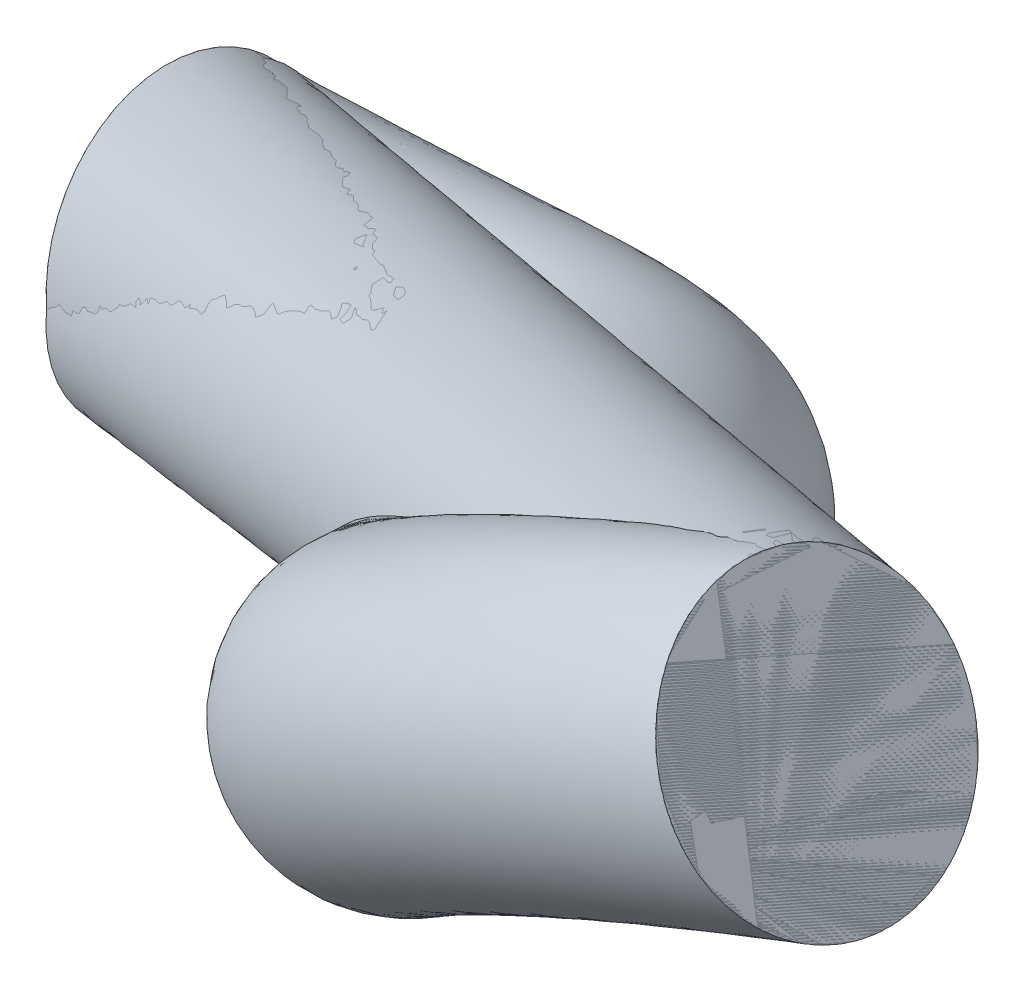
ISO-10303-21;
HEADER;
FILE_DESCRIPTION(('STEP AP214'),'2;1');
FILE_NAME('part.step','',(''),(''),'','','');
FILE_SCHEMA(('AUTOMOTIVE_DESIGN { 1 0 10303 214 1 1 1 1 }'));
ENDSEC;
DATA;
#1=APPLICATION_CONTEXT('core data for automotive mechanical design processes');
#2=APPLICATION_PROTOCOL_DEFINITION('international standard','automotive_design',2000,#1);
#3=PRODUCT_CONTEXT('',#1,'mechanical');
#4=PRODUCT('Part','Part','',(#3));
#5=PRODUCT_RELATED_PRODUCT_CATEGORY('part','',(#4));
#6=PRODUCT_DEFINITION_FORMATION('','',#4);
#7=PRODUCT_DEFINITION_CONTEXT('part definition',#1,'design');
#8=PRODUCT_DEFINITION('design','',#6,#7);
#9=PRODUCT_DEFINITION_SHAPE('','',#8);
#10=(LENGTH_UNIT() NAMED_UNIT(*) SI_UNIT(.MILLI.,.METRE.));
#11=(NAMED_UNIT(*) PLANE_ANGLE_UNIT() SI_UNIT($,.RADIAN.));
#12=(NAMED_UNIT(*) SI_UNIT($,.STERADIAN.) SOLID_ANGLE_UNIT());
#13=UNCERTAINTY_MEASURE_WITH_UNIT(LENGTH_MEASURE(1.E-05),#10,'distance_accuracy_value','');
#14=(GEOMETRIC_REPRESENTATION_CONTEXT(3) GLOBAL_UNCERTAINTY_ASSIGNED_CONTEXT((#13)) GLOBAL_UNIT_ASSIGNED_CONTEXT((#10,
#11,#12)) REPRESENTATION_CONTEXT('',''));
#15=CARTESIAN_POINT('',(0.,0.,0.));
#16=DIRECTION('',(0.,0.,1.));
#17=DIRECTION('',(1.,0.,0.));
#18=AXIS2_PLACEMENT_3D('',#15,#16,#17);
#19=CARTESIAN_POINT('',(0.,0.,0.));
#20=DIRECTION('',(0.986252063805547,0.164566009516546,-0.0149965046294042));
#21=DIRECTION('',(-0.164584517687191,0.986362984168442,0.));
#22=AXIS2_PLACEMENT_3D('',#19,#20,#21);
#23=PLANE('',#22);
#24=CARTESIAN_POINT('',(0.,0.,0.));
#25=DIRECTION('',(0.986252063805547,0.164566009516546,-0.0149965046294042));
#26=DIRECTION('',(-0.154927182454119,0.952408669839192,0.262517225629039));
#27=AXIS2_PLACEMENT_3D('',#24,#25,#26);
#28=CIRCLE('',#27,1.1);
#29=CARTESIAN_POINT('',(0.181637129272555,-1.08344944835674,0.0560824939271524));
#30=VERTEX_POINT('',#29);
#31=EDGE_CURVE('E12',#30,#30,#28,.T.);
#32=ORIENTED_EDGE('',*,*,#31,.F.);
#33=EDGE_LOOP('',(#32));
#34=FACE_BOUND('',#33,.T.);
#35=ADVANCED_FACE('F78',(#34),#23,.F.);
#36=CARTESIAN_POINT('',(12.,6.23926176341122,7.16624702187243));
#37=DIRECTION('',(0.866025403784438,0.499846355518911,0.0123943888297814));
#38=DIRECTION('',(-0.499884753360116,0.866091931239459,0.));
#39=AXIS2_PLACEMENT_3D('',#36,#37,#38);
#40=PLANE('',#39);
#41=CARTESIAN_POINT('',(12.,6.23926176341122,7.16624702187243));
#42=DIRECTION('',(0.866025403784438,0.499846355518911,0.0123943888297814));
#43=DIRECTION('',(-0.499884753360116,0.866091931239459,0.));
#44=AXIS2_PLACEMENT_3D('',#41,#42,#43);
#45=CIRCLE('',#44,1.1);
#46=CARTESIAN_POINT('',(12.4702423502606,5.43917079747186,6.57571626209479));
#47=VERTEX_POINT('',#46);
#48=EDGE_CURVE('E86',#47,#47,#45,.T.);
#49=ORIENTED_EDGE('',*,*,#48,.T.);
#50=EDGE_LOOP('',(#49));
#51=FACE_BOUND('',#50,.T.);
#52=ADVANCED_FACE('F110',(#51),#40,.T.);
#53=CARTESIAN_POINT('',(12.4702423502606,5.43917079747186,6.57571626209479));
#54=CARTESIAN_POINT('',(0.181637129272555,-1.08344944835674,0.0560824939271524));
#55=CARTESIAN_POINT('',(12.4940138510578,5.39606721362045,6.65304526433065));
#56=CARTESIAN_POINT('',(0.182222019475779,-1.07861316523766,0.147619623261756));
#57=CARTESIAN_POINT('',(12.5161390502769,5.35541602802259,6.74650387669227));
#58=CARTESIAN_POINT('',(0.181043057697036,-1.06216340736333,0.250598121359932));
#59=CARTESIAN_POINT('',(12.5464707475803,5.29727676071481,6.97182200330451));
#60=CARTESIAN_POINT('',(0.17163069267193,-0.985559710921361,0.472209776108738));
#61=CARTESIAN_POINT('',(12.5545405529484,5.28000849698423,7.10436764650442));
#62=CARTESIAN_POINT('',(0.16330322376293,-0.92480471848895,0.591252400316749));
#63=CARTESIAN_POINT('',(12.5401568189474,5.29767787687492,7.39681481379265));
#64=CARTESIAN_POINT('',(0.135738601999572,-0.739071921967012,0.81661425238499));
#65=CARTESIAN_POINT('',(12.5170170999344,5.33379996713204,7.55689445629629));
#66=CARTESIAN_POINT('',(0.116291234885146,-0.612893304653535,0.922285915520443));
#67=CARTESIAN_POINT('',(12.4289604230738,5.47891499254113,7.85736127265259));
#68=CARTESIAN_POINT('',(0.0670472675572752,-0.304408415983946,1.06893093526143));
#69=CARTESIAN_POINT('',(12.3636317346091,5.58867026287107,7.99577325540651));
#70=CARTESIAN_POINT('',(0.0372915373174332,-0.122539510630433,1.10779263433644));
#71=CARTESIAN_POINT('',(12.2068842845222,5.85536725151752,8.19261684199906));
#72=CARTESIAN_POINT('',(-0.0232541724400874,0.238610305488481,1.08909846969405));
#73=CARTESIAN_POINT('',(12.1165502803401,6.01046331593337,8.2496862064841));
#74=CARTESIAN_POINT('',(-0.0536251505061572,0.415391909567939,1.03167197735827));
#75=CARTESIAN_POINT('',(11.9442651715892,6.30830522668448,8.2761568349874));
#76=CARTESIAN_POINT('',(-0.10494153156448,0.706740625524921,0.853977826031315));
#77=CARTESIAN_POINT('',(11.863007834572,6.4498088678276,8.24717910787245));
#78=CARTESIAN_POINT('',(-0.125818864152918,0.821095283666699,0.735855461129889));
#79=CARTESIAN_POINT('',(11.7269140164897,6.6881685970375,8.14370178371307));
#80=CARTESIAN_POINT('',(-0.15637812375678,0.982066310618919,0.492547211004959));
#81=CARTESIAN_POINT('',(11.6716945781355,6.78565931495293,8.07036669136021));
#82=CARTESIAN_POINT('',(-0.166262804342842,1.02994518287508,0.36788138207252));
#83=CARTESIAN_POINT('',(11.5851845947208,6.9393827829916,7.91559730618274));
#84=CARTESIAN_POINT('',(-0.178550021694831,1.08277758053012,0.139569738715882));
#85=CARTESIAN_POINT('',(11.5535291505365,6.99624914549917,7.83410678388594));
#86=CARTESIAN_POINT('',(-0.181052239069346,1.08828573147583,0.0354546354074498));
#87=CARTESIAN_POINT('',(11.5059861489422,7.08245631320199,7.67944877941421));
#88=CARTESIAN_POINT('',(-0.182222019475792,1.07861316523766,-0.147619623261758));
#89=CARTESIAN_POINT('',(11.4838609497231,7.12310749879985,7.58599016705259));
#90=CARTESIAN_POINT('',(-0.18104305769705,1.06216340736333,-0.250598121359933));
#91=CARTESIAN_POINT('',(11.4535292524197,7.18124676610763,7.36067204044035));
#92=CARTESIAN_POINT('',(-0.171630692671944,0.98555971092136,-0.47220977610874));
#93=CARTESIAN_POINT('',(11.4454594470516,7.19851502983821,7.22812639724046));
#94=CARTESIAN_POINT('',(-0.163303223762944,0.924804718488949,-0.59125240031675));
#95=CARTESIAN_POINT('',(11.4598431810526,7.18084564994752,6.93567922995222));
#96=CARTESIAN_POINT('',(-0.135738601999585,0.739071921967011,-0.816614252384992));
#97=CARTESIAN_POINT('',(11.4829829000656,7.14472355969039,6.77559958744858));
#98=CARTESIAN_POINT('',(-0.11629123488516,0.612893304653534,-0.922285915520444));
#99=CARTESIAN_POINT('',(11.5710395769262,6.9996085342813,6.47513277109227));
#100=CARTESIAN_POINT('',(-0.067047267557289,0.304408415983946,-1.06893093526143));
#101=CARTESIAN_POINT('',(11.6363682653909,6.88985326395137,6.33672078833836));
#102=CARTESIAN_POINT('',(-0.0372915373174471,0.122539510630432,-1.10779263433644));
#103=CARTESIAN_POINT('',(11.7931157154778,6.62315627530492,6.13987720174581));
#104=CARTESIAN_POINT('',(0.0232541724400734,-0.238610305488481,-1.08909846969406));
#105=CARTESIAN_POINT('',(11.8834497196599,6.46806021088907,6.08280783726076));
#106=CARTESIAN_POINT('',(0.0536251505061432,-0.415391909567939,-1.03167197735827));
#107=CARTESIAN_POINT('',(12.0557348284107,6.17021830013795,6.05633720875747));
#108=CARTESIAN_POINT('',(0.104941531564466,-0.706740625524921,-0.853977826031317));
#109=CARTESIAN_POINT('',(12.136992165428,6.02871465899484,6.08531493587242));
#110=CARTESIAN_POINT('',(0.125818864152904,-0.8210952836667,-0.735855461129892));
#111=CARTESIAN_POINT('',(12.2730859835103,5.79035492978493,6.1887922600318));
#112=CARTESIAN_POINT('',(0.156378123756766,-0.98206631061892,-0.492547211004962));
#113=CARTESIAN_POINT('',(12.3283054218645,5.69286421186951,6.26212735238467));
#114=CARTESIAN_POINT('',(0.166262804342828,-1.02994518287508,-0.367881382072523));
#115=CARTESIAN_POINT('',(12.4148154052791,5.53914074383084,6.41689673756214));
#116=CARTESIAN_POINT('',(0.178550021694817,-1.08277758053012,-0.139569738715884));
#117=CARTESIAN_POINT('',(12.4464708494635,5.48227438132327,6.49838725985893));
#118=CARTESIAN_POINT('',(0.181052239069332,-1.08828573147583,-0.0354546354074517));
#119=CARTESIAN_POINT('',(12.4702423502606,5.43917079747186,6.57571626209479));
#120=CARTESIAN_POINT('',(0.181637129272555,-1.08344944835674,0.0560824939271524));
#121=B_SPLINE_SURFACE_WITH_KNOTS('',3,1,((#53,#54),(#55,#56),(#57,#58),(#59,#60),(#61,#62),(#63,
#64),(#65,#66),(#67,#68),(#69,#70),(#71,#72),(#73,#74),(#75,#76),(#77,#78),(#79,#80),(#81,#82),
(#83,#84),(#85,#86),(#87,#88),(#89,#90),(#91,#92),(#93,#94),(#95,#96),(#97,#98),(#99,#100),
(#101,#102),(#103,#104),(#105,#106),(#107,#108),(#109,#110),(#111,#112),(#113,#114),(#115,#116),
(#117,#118),(#119,#120)),.UNSPECIFIED.,.T.,.F.,.F.,(4,2,2,2,2,2,2,2,2,2,2,2,2,2,2,2,4),(2,2),
(0.,0.0624999999999998,0.125,0.187499999999999,0.249999999999999,0.312499999999999,
0.374999999999999,0.437499999999998,0.499999999999998,0.562499999999998,0.624999999999999,
0.687499999999999,0.749999999999999,0.812499999999999,0.875,0.9375,1.),(0.,1.),.UNSPECIFIED.);
#122=CARTESIAN_POINT('',(12.4702423502606,5.43917079747186,6.57571626209479));
#123=CARTESIAN_POINT('',(12.3422360458754,5.37122683657781,6.50780341034305));
#124=CARTESIAN_POINT('',(12.2142297414901,5.30328287568376,6.4398905585913));
#125=CARTESIAN_POINT('',(11.9582171327195,5.16739495389567,6.30406485508781));
#126=CARTESIAN_POINT('',(11.8302108283342,5.09945099300162,6.23615200333606));
#127=CARTESIAN_POINT('',(11.5741982195636,4.96356307121352,6.10032629983257));
#128=CARTESIAN_POINT('',(11.4461919151783,4.89561911031948,6.03241344808082));
#129=CARTESIAN_POINT('',(11.1901793064077,4.75973118853138,5.89658774457733));
#130=CARTESIAN_POINT('',(11.0621730020224,4.69178722763733,5.82867489282558));
#131=CARTESIAN_POINT('',(10.8061603932518,4.55589930584924,5.69284918932209));
#132=CARTESIAN_POINT('',(10.6781540888666,4.48795534495519,5.62493633757034));
#133=CARTESIAN_POINT('',(10.422141480096,4.35206742316709,5.48911063406685));
#134=CARTESIAN_POINT('',(10.2941351757107,4.28412346227304,5.42119778231511));
#135=CARTESIAN_POINT('',(10.0381225669401,4.14823554048495,5.28537207881161));
#136=CARTESIAN_POINT('',(9.91011626255479,4.0802915795909,5.21745922705987));
#137=CARTESIAN_POINT('',(9.65410365378421,3.9444036578028,5.08163352355638));
#138=CARTESIAN_POINT('',(9.52609734939892,3.87645969690876,5.01372067180463));
#139=CARTESIAN_POINT('',(9.27008474062833,3.74057177512066,4.87789496830114));
#140=CARTESIAN_POINT('',(9.14207843624304,3.67262781422661,4.80998211654939));
#141=CARTESIAN_POINT('',(8.88606582747245,3.53673989243852,4.6741564130459));
#142=CARTESIAN_POINT('',(8.75805952308716,3.46879593154447,4.60624356129415));
#143=CARTESIAN_POINT('',(8.50204691431657,3.33290800975637,4.47041785779066));
#144=CARTESIAN_POINT('',(8.37404060993128,3.26496404886232,4.40250500603891));
#145=CARTESIAN_POINT('',(8.1180280011607,3.12907612707423,4.26667930253542));
#146=CARTESIAN_POINT('',(7.9900216967754,3.06113216618018,4.19876645078367));
#147=CARTESIAN_POINT('',(7.73400908800482,2.92524424439208,4.06294074728018));
#148=CARTESIAN_POINT('',(7.60600278361953,2.85730028349804,3.99502789552843));
#149=CARTESIAN_POINT('',(7.34999017484894,2.72141236170994,3.85920219202494));
#150=CARTESIAN_POINT('',(7.22198387046365,2.65346840081589,3.7912893402732));
#151=CARTESIAN_POINT('',(6.96597126169306,2.5175804790278,3.6554636367697));
#152=CARTESIAN_POINT('',(6.83796495730777,2.44963651813375,3.58755078501796));
#153=CARTESIAN_POINT('',(6.58195234853719,2.31374859634565,3.45172508151446));
#154=CARTESIAN_POINT('',(6.45394604415189,2.24580463545161,3.38381222976272));
#155=CARTESIAN_POINT('',(6.19793343538131,2.10991671366351,3.24798652625923));
#156=CARTESIAN_POINT('',(6.06992713099601,2.04197275276946,3.18007367450748));
#157=CARTESIAN_POINT('',(5.81391452222543,1.90608483098137,3.04424797100399));
#158=CARTESIAN_POINT('',(5.68590821784014,1.83814087008732,2.97633511925224));
#159=CARTESIAN_POINT('',(5.42989560906955,1.70225294829922,2.84050941574875));
#160=CARTESIAN_POINT('',(5.30188930468426,1.63430898740517,2.772596563997));
#161=CARTESIAN_POINT('',(5.04587669591367,1.49842106561708,2.63677086049351));
#162=CARTESIAN_POINT('',(4.91787039152838,1.43047710472303,2.56885800874176));
#163=CARTESIAN_POINT('',(4.6618577827578,1.29458918293493,2.43303230523827));
#164=CARTESIAN_POINT('',(4.5338514783725,1.22664522204089,2.36511945348652));
#165=CARTESIAN_POINT('',(4.27783886960192,1.09075730025279,2.22929374998303));
#166=CARTESIAN_POINT('',(4.14983256521663,1.02281333935874,2.16138089823129));
#167=CARTESIAN_POINT('',(3.89381995644604,0.886925417570646,2.02555519472779));
#168=CARTESIAN_POINT('',(3.76581365206075,0.818981456676598,1.95764234297605));
#169=CARTESIAN_POINT('',(3.50980104329016,0.683093534888502,1.82181663947255));
#170=CARTESIAN_POINT('',(3.38179473890487,0.615149573994454,1.75390378772081));
#171=CARTESIAN_POINT('',(3.12578213013429,0.479261652206359,1.61807808421732));
#172=CARTESIAN_POINT('',(2.99777582574899,0.411317691312311,1.55016523246557));
#173=CARTESIAN_POINT('',(2.74176321697841,0.275429769524215,1.41433952896208));
#174=CARTESIAN_POINT('',(2.61375691259311,0.207485808630167,1.34642667721033));
#175=CARTESIAN_POINT('',(2.35774430382253,0.0715978868420709,1.21060097370684));
#176=CARTESIAN_POINT('',(2.22973799943724,0.00365392594802291,1.14268812195509));
#177=CARTESIAN_POINT('',(1.97372539066665,-0.132233995840073,1.0068624184516));
#178=CARTESIAN_POINT('',(1.84571908628136,-0.200177956734121,0.938949566699854));
#179=CARTESIAN_POINT('',(1.58970647751077,-0.336065878522217,0.803123863196361));
#180=CARTESIAN_POINT('',(1.46170017312548,-0.404009839416265,0.735211011444615));
#181=CARTESIAN_POINT('',(1.2056875643549,-0.539897761204361,0.599385307941122));
#182=CARTESIAN_POINT('',(1.0776812599696,-0.607841722098409,0.531472456189376));
#183=CARTESIAN_POINT('',(0.821668651199018,-0.743729643886505,0.395646752685884));
#184=CARTESIAN_POINT('',(0.693662346813726,-0.811673604780552,0.327733900934137));
#185=CARTESIAN_POINT('',(0.437649738043141,-0.947561526568648,0.191908197430645));
#186=CARTESIAN_POINT('',(0.309643433657848,-1.0155054874627,0.123995345678899));
#187=CARTESIAN_POINT('',(0.181637129272555,-1.08344944835674,0.0560824939271524));
#188=B_SPLINE_CURVE_WITH_KNOTS('',3,(#122,#123,#124,#125,#126,#127,#128,#129,#130,#131,#132,
#133,#134,#135,#136,#137,#138,#139,#140,#141,#142,#143,#144,#145,#146,#147,#148,#149,#150,#151,
#152,#153,#154,#155,#156,#157,#158,#159,#160,#161,#162,#163,#164,#165,#166,#167,#168,#169,#170,
#171,#172,#173,#174,#175,#176,#177,#178,#179,#180,#181,#182,#183,#184,#185,#186,#187),
.UNSPECIFIED.,.F.,.F.,(4,2,2,2,2,2,2,2,2,2,2,2,2,2,2,2,2,2,2,2,2,2,2,2,2,2,2,2,2,2,2,2,4),(0.,
0.480132649334183,0.960265298668365,1.44039794800255,1.92053059733673,2.40066324667091,
2.88079589600509,3.36092854533928,3.84106119467346,4.32119384400764,4.80132649334182,
5.28145914267601,5.76159179201019,6.24172444134437,6.72185709067855,7.20198974001273,
7.68212238934692,8.1622550386811,8.64238768801528,9.12252033734947,9.60265298668365,
10.0827856360178,10.562918285352,11.0430509346862,11.5231835840204,12.0033162333546,
12.4834488826887,12.9635815320229,13.4437141813571,13.9238468306913,14.4039794800255,
14.8841121293597,15.3642447786938),.UNSPECIFIED.);
#189=EDGE_CURVE('BSEAM118',#47,#30,#188,.T.);
#190=ORIENTED_EDGE('',*,*,#48,.F.);
#191=ORIENTED_EDGE('',*,*,#31,.T.);
#192=ORIENTED_EDGE('',*,*,#189,.T.);
#193=ORIENTED_EDGE('',*,*,#189,.F.);
#194=EDGE_LOOP('',(#190,#192,#191,#193));
#195=FACE_BOUND('',#194,.T.);
#196=ADVANCED_FACE('F118',(#195),#121,.T.);
#197=CLOSED_SHELL('',(#35,#52,#196));
#198=MANIFOLD_SOLID_BREP('B2',#197);
#199=CARTESIAN_POINT('',(0.,0.,0.));
#200=DIRECTION('',(0.986252063805547,0.164566009516546,-0.0149965046294042));
#201=DIRECTION('',(-0.154927182454119,0.952408669839192,0.262517225629039));
#202=AXIS2_PLACEMENT_3D('',#199,#200,#201);
#203=PLANE('',#202);
#204=CARTESIAN_POINT('',(0.,0.,0.));
#205=DIRECTION('',(0.986252063805547,0.164566009516546,-0.0149965046294042));
#206=DIRECTION('',(-0.154927182454119,0.952408669839192,0.262517225629039));
#207=AXIS2_PLACEMENT_3D('',#204,#205,#206);
#208=CIRCLE('',#207,1.1);
#209=CARTESIAN_POINT('',(-0.170419900699537,1.04764953682311,0.288768948191942));
#210=VERTEX_POINT('',#209);
#211=EDGE_CURVE('E184',#210,#210,#208,.T.);
#212=ORIENTED_EDGE('',*,*,#211,.F.);
#213=EDGE_LOOP('',(#212));
#214=FACE_BOUND('',#213,.T.);
#215=ADVANCED_FACE('F177',(#214),#203,.F.);
#216=CARTESIAN_POINT('',(12.,6.23926176341122,7.16624702187243));
#217=DIRECTION('',(0.866025403784438,0.499846355518911,0.0123943888297814));
#218=DIRECTION('',(-0.499884753360116,0.866091931239459,0.));
#219=AXIS2_PLACEMENT_3D('',#216,#217,#218);
#220=PLANE('',#219);
#221=CARTESIAN_POINT('',(12.,6.23926176341122,7.16624702187243));
#222=DIRECTION('',(0.866025403784438,0.499846355518911,0.0123943888297814));
#223=DIRECTION('',(-0.499884753360116,0.866091931239459,0.));
#224=AXIS2_PLACEMENT_3D('',#221,#222,#223);
#225=CIRCLE('',#224,1.1);
#226=CARTESIAN_POINT('',(11.4501267713039,7.19196288777462,7.16624702187243));
#227=VERTEX_POINT('',#226);
#228=EDGE_CURVE('E76',#227,#227,#225,.T.);
#229=ORIENTED_EDGE('',*,*,#228,.T.);
#230=EDGE_LOOP('',(#229));
#231=FACE_BOUND('',#230,.T.);
#232=ADVANCED_FACE('F191',(#231),#220,.T.);
#233=CARTESIAN_POINT('',(-0.170419900699539,1.04764953682311,0.288768948191941));
#234=CARTESIAN_POINT('',(0.473264334735306,1.06923604834696,0.299212840866446));
#235=CARTESIAN_POINT('',(1.0991581380759,1.12236874517422,0.319440903231738));
#236=CARTESIAN_POINT('',(1.98942101504521,1.26299164667755,0.412783192179105));
#237=CARTESIAN_POINT('',(2.28120000959659,1.32228667833676,0.453094852170053));
#238=CARTESIAN_POINT('',(2.836379990738,1.46171020795116,0.579134628883695));
#239=CARTESIAN_POINT('',(3.09665258659056,1.54037140772899,0.664881578208361));
#240=CARTESIAN_POINT('',(3.57208294382386,1.71568499336394,0.902735057650312));
#241=CARTESIAN_POINT('',(3.79047001432895,1.81280893740871,1.07070932425622));
#242=CARTESIAN_POINT('',(4.18608275360607,2.01502418161229,1.4852776973141));
#243=CARTESIAN_POINT('',(4.36361066943153,2.12046114577217,1.72918360916092));
#244=CARTESIAN_POINT('',(4.68039247795302,2.32801144849916,2.25686012619045));
#245=CARTESIAN_POINT('',(4.82378862308739,2.43128069770416,2.53384972997274));
#246=CARTESIAN_POINT('',(5.10010727050088,2.64847341687711,3.08957022983166));
#247=CARTESIAN_POINT('',(5.23333931798411,2.76310288940918,3.37121979803631));
#248=CARTESIAN_POINT('',(5.64221161659854,3.13553749812254,4.18756164369797));
#249=CARTESIAN_POINT('',(5.92164780973814,3.42818052419124,4.70729896274631));
#250=CARTESIAN_POINT('',(6.65149195493829,4.1773414021836,5.64594572284659));
#251=CARTESIAN_POINT('',(7.10439172283666,4.62343855990236,6.03695758366435));
#252=CARTESIAN_POINT('',(7.95320817163656,5.28288363850914,6.46433675113768));
#253=CARTESIAN_POINT('',(8.24866706838278,5.48931377824904,6.57984178370921));
#254=CARTESIAN_POINT('',(8.85876197277774,5.88083893843533,6.77336934676646));
#255=CARTESIAN_POINT('',(9.17293410140316,6.06543378651149,6.85044815004052));
#256=CARTESIAN_POINT('',(10.1317360367405,6.59070820004162,7.03938693949413));
#257=CARTESIAN_POINT('',(10.792457758331,6.90298063777938,7.10934730681903));
#258=CARTESIAN_POINT('',(11.4501267713039,7.19196288777462,7.16624702187243));
#259=CARTESIAN_POINT('',(-0.0439546314891411,0.483163000248157,2.41135262986604));
#260=CARTESIAN_POINT('',(0.59255118795713,0.50924716906367,2.42342033963845));
#261=CARTESIAN_POINT('',(1.1722451965718,0.566164253720242,2.44814072249747));
#262=CARTESIAN_POINT('',(1.94592953815061,0.699131332202064,2.53920917145489));
#263=CARTESIAN_POINT('',(2.16438022463886,0.749048980074052,2.57703818659255));
#264=CARTESIAN_POINT('',(2.49681229862738,0.838912724686828,2.66484808751747));
#265=CARTESIAN_POINT('',(2.623322921824,0.884019908459325,2.72249546150886));
#266=CARTESIAN_POINT('',(2.71923558328097,0.922915813018582,2.78229068472823));
#267=CARTESIAN_POINT('',(2.76732943642385,0.944745565758012,2.82170314913145));
#268=CARTESIAN_POINT('',(2.94260731918976,1.03893449218882,3.02389651529198));
#269=CARTESIAN_POINT('',(3.04126577776533,1.09786862948456,3.16163249032263));
#270=CARTESIAN_POINT('',(3.27365634539114,1.25446025396404,3.56636279579994));
#271=CARTESIAN_POINT('',(3.40973687958098,1.35344128943233,3.82950657338896));
#272=CARTESIAN_POINT('',(3.68207924754717,1.57250251102738,4.3824313653352));
#273=CARTESIAN_POINT('',(3.82887019846302,1.7001810760408,4.69060389665411));
#274=CARTESIAN_POINT('',(4.31073666270001,2.14728352456498,5.63772664811335));
#275=CARTESIAN_POINT('',(4.66593345997431,2.52210617948447,6.29271832737384));
#276=CARTESIAN_POINT('',(5.69703197150708,3.57348604889111,7.5526949858752));
#277=CARTESIAN_POINT('',(6.35766747440298,4.20156076401495,8.07416136288542));
#278=CARTESIAN_POINT('',(7.45869661467984,5.03542732106578,8.59639655393979));
#279=CARTESIAN_POINT('',(7.81661191805503,5.27884555408869,8.72802656187874));
#280=CARTESIAN_POINT('',(8.55558179379482,5.74307345650696,8.94932174223945));
#281=CARTESIAN_POINT('',(8.92690193163067,5.95661219798874,9.03458816885258));
#282=CARTESIAN_POINT('',(10.0294863761137,6.55011167607946,9.23921950185057));
#283=CARTESIAN_POINT('',(10.7491622619641,6.88353896233206,9.30893104545188));
#284=CARTESIAN_POINT('',(11.426510474956,7.17833220256753,9.3660780324202));
#285=CARTESIAN_POINT('',(0.296885169909921,-1.61213607339807,1.83381473348215));
#286=CARTESIAN_POINT('',(1.01040103095288,-1.57475169620334,1.85033369701022));
#287=CARTESIAN_POINT('',(1.69032328584829,-1.50168872097537,1.88484152386714));
#288=CARTESIAN_POINT('',(2.67331793272185,-1.31236854260675,2.01939811680375));
#289=CARTESIAN_POINT('',(2.97555264021658,-1.23724756789314,2.08025419672151));
#290=CARTESIAN_POINT('',(3.48337341333048,-1.08491098192635,2.24560055564683));
#291=CARTESIAN_POINT('',(3.70775073773934,-0.999595850678876,2.35771529653554));
#292=CARTESIAN_POINT('',(3.98354672036421,-0.871369452233886,2.58451473209797));
#293=CARTESIAN_POINT('',(4.08594458330272,-0.814902854772635,2.7124522457592));
#294=CARTESIAN_POINT('',(4.33317975243192,-0.667604900835397,3.05669680138959));
#295=CARTESIAN_POINT('',(4.44889017118006,-0.590887587076745,3.25333249413738));
#296=CARTESIAN_POINT('',(4.70268464596837,-0.410284193726501,3.73434488326333));
#297=CARTESIAN_POINT('',(4.84957637373671,-0.29854976355324,4.02661024119832));
#298=CARTESIAN_POINT('',(5.14439558260055,-0.0520859448409063,4.63423555571794));
#299=CARTESIAN_POINT('',(5.30222808128402,0.0888249880385071,4.96214962494514));
#300=CARTESIAN_POINT('',(5.82813042770781,0.58888959347603,5.97369747093731));
#301=CARTESIAN_POINT('',(6.2201366956321,1.00852353793423,6.65934840105593));
#302=CARTESIAN_POINT('',(7.28492691062596,2.08539174754764,7.87682868553776));
#303=CARTESIAN_POINT('',(7.91759065627747,2.66307953269189,8.31391800340965));
#304=CARTESIAN_POINT('',(8.89715241794761,3.3752113610618,8.73413230946596));
#305=CARTESIAN_POINT('',(9.21542450068391,3.58373422026931,8.84145328317733));
#306=CARTESIAN_POINT('',(9.87703948950647,3.98476325939406,9.02031124167672));
#307=CARTESIAN_POINT('',(10.2115839339315,4.17100365993622,9.08933467664388));
#308=CARTESIAN_POINT('',(11.2145678119904,4.69471172134534,9.25608722019213));
#309=CARTESIAN_POINT('',(11.882532628748,4.99754352080727,9.3142171124713));
#310=CARTESIAN_POINT('',(12.5262569323483,5.27292995384072,9.3660780324202));
#311=CARTESIAN_POINT('',(0.170419900699522,-1.04764953682311,-0.288768948191944));
#312=CARTESIAN_POINT('',(0.891114177733723,-1.01476281692019,-0.273873801762224));
#313=CARTESIAN_POINT('',(1.61723622735268,-0.945484229521254,-0.243858295398306));
#314=CARTESIAN_POINT('',(2.71680940961631,-0.748508228131332,-0.107027862472181));
#315=CARTESIAN_POINT('',(3.09237242517417,-0.664009869630206,-0.0436891377009079));
#316=CARTESIAN_POINT('',(3.82294110544125,-0.462113498662249,0.159887097012977));
#317=CARTESIAN_POINT('',(4.18108040250561,-0.343244351409138,0.300101413235194));
#318=CARTESIAN_POINT('',(4.83639408090739,-0.0786002718886038,0.704959105019894));
#319=CARTESIAN_POINT('',(5.10908516120752,0.0531605168780637,0.961458420884127));
#320=CARTESIAN_POINT('',(5.57665518684853,0.308484788588073,1.51807798341155));
#321=CARTESIAN_POINT('',(5.77123506284619,0.431704929210916,1.82088361297582));
#322=CARTESIAN_POINT('',(6.10942077853032,0.663267000808558,2.42484221365369));
#323=CARTESIAN_POINT('',(6.26362811724297,0.779289644718552,2.7309533977821));
#324=CARTESIAN_POINT('',(6.56242360555441,1.02388496100886,3.34137442021441));
#325=CARTESIAN_POINT('',(6.70669720080511,1.15174680140688,3.6427655263272));
#326=CARTESIAN_POINT('',(7.15960538160634,1.57714356703359,4.52353246652224));
#327=CARTESIAN_POINT('',(7.4758510453967,1.91459788264115,5.0739290364281));
#328=CARTESIAN_POINT('',(8.23938689405641,2.68924710083998,5.97007942250945));
#329=CARTESIAN_POINT('',(8.66431490471131,3.08495732857915,6.27671422418858));
#330=CARTESIAN_POINT('',(9.39166397490425,3.62266767850524,6.60207250666385));
#331=CARTESIAN_POINT('',(9.64747965101166,3.79420244442975,6.69326850500794));
#332=CARTESIAN_POINT('',(10.1802196684894,4.12252874132234,6.84435884620359));
#333=CARTESIAN_POINT('',(10.457616103704,4.2798252484589,6.90519465783182));
#334=CARTESIAN_POINT('',(11.3168174726171,4.73530824530765,7.0562546578357));
#335=CARTESIAN_POINT('',(11.925828125114,5.01698519625444,7.11463337383967));
#336=CARTESIAN_POINT('',(12.5498732286961,5.28656063904781,7.16624702187243));
#337=CARTESIAN_POINT('',(0.0439546314891237,-0.483163000248158,-2.41135262986604));
#338=CARTESIAN_POINT('',(0.771827324514564,-0.454773937637046,-2.39808130053467));
#339=CARTESIAN_POINT('',(1.54414916885708,-0.389279738067133,-2.37255811466375));
#340=CARTESIAN_POINT('',(2.76030088651077,-0.184647913655915,-2.23345384174811));
#341=CARTESIAN_POINT('',(3.20919221013175,-0.0907721713672785,-2.16763247212333));
#342=CARTESIAN_POINT('',(4.16250879755202,0.160683984601855,-1.92582636162087));
#343=CARTESIAN_POINT('',(4.65441006727188,0.313107147860601,-1.75751247006515));
#344=CARTESIAN_POINT('',(5.68924144145059,0.714168908456678,-1.17459652205818));
#345=CARTESIAN_POINT('',(6.13222573911231,0.921223888528761,-0.78953540399095));
#346=CARTESIAN_POINT('',(6.82013062126514,1.28457447801154,-0.0205408345664811));
#347=CARTESIAN_POINT('',(7.09357995451232,1.45429744549858,0.388434731814263));
#348=CARTESIAN_POINT('',(7.51615691109227,1.73681819534362,1.11533954404405));
#349=CARTESIAN_POINT('',(7.67767986074923,1.85712905299034,1.43529655436588));
#350=CARTESIAN_POINT('',(7.98045162850827,2.09985586685862,2.04851328471087));
#351=CARTESIAN_POINT('',(8.1111663203262,2.21466861477526,2.32338142770925));
#352=CARTESIAN_POINT('',(8.49108033550488,2.56539754059116,3.07336746210716));
#353=CARTESIAN_POINT('',(8.73156539516129,2.82067222734807,3.48850967180027));
#354=CARTESIAN_POINT('',(9.19384687748686,3.29310245413231,4.06333015948115));
#355=CARTESIAN_POINT('',(9.41103915314515,3.50683512446641,4.23951044496751));
#356=CARTESIAN_POINT('',(9.88617553186089,3.87012399594868,4.47001270386174));
#357=CARTESIAN_POINT('',(10.0795348013394,4.00467066859018,4.54508372683856));
#358=CARTESIAN_POINT('',(10.4833998474723,4.26029422325063,4.66840645073045));
#359=CARTESIAN_POINT('',(10.7036482734765,4.38864683698157,4.72105463901976));
#360=CARTESIAN_POINT('',(11.4190671332439,4.77590476926996,4.85642209547926));
#361=CARTESIAN_POINT('',(11.9691236214801,5.03642687170161,4.91504963520803));
#362=CARTESIAN_POINT('',(12.573489525044,5.30019132425491,4.96641601132467));
#363=CARTESIAN_POINT('',(-0.296885169909935,1.61213607339807,-1.83381473348215));
#364=CARTESIAN_POINT('',(0.353977481513485,1.62922492763026,-1.82499465790556));
#365=CARTESIAN_POINT('',(1.02607107958,1.67857323662819,-1.809258916034));
#366=CARTESIAN_POINT('',(2.03291249193983,1.82685196115305,-1.71364278709668));
#367=CARTESIAN_POINT('',(2.39801979455432,1.89552437659946,-1.67084848225244));
#368=CARTESIAN_POINT('',(3.17594768284862,2.08450769121548,-1.50657882975008));
#369=CARTESIAN_POINT('',(3.56998225135713,2.19672290699865,-1.39273230509214));
#370=CARTESIAN_POINT('',(4.42493030436676,2.50845417370929,-0.976820569427613));
#371=CARTESIAN_POINT('',(4.81361059223404,2.68087230905941,-0.680284500619006));
#372=CARTESIAN_POINT('',(5.42955818802237,2.99111387103576,-0.0533411206637886));
#373=CARTESIAN_POINT('',(5.68595556109774,3.14305366205977,0.296734727999215));
#374=CARTESIAN_POINT('',(6.0871286105149,3.40156264303427,0.947357456580961));
#375=CARTESIAN_POINT('',(6.23784036659381,3.50912010597599,1.23819288655652));
#376=CARTESIAN_POINT('',(6.5181352934546,3.72444432272683,1.79670909432813));
#377=CARTESIAN_POINT('',(6.6378084375052,3.82602470277756,2.05183569941851));
#378=CARTESIAN_POINT('',(6.97368657049708,4.12379147168011,2.7373966392826));
#379=CARTESIAN_POINT('',(7.17736215950197,4.33425486889801,3.12187959811879));
#380=CARTESIAN_POINT('',(7.6059519383695,4.78119675547609,3.73919645981798));
#381=CARTESIAN_POINT('',(7.85111597127035,5.04531635578977,3.99975380444329));
#382=CARTESIAN_POINT('',(8.44771972859328,5.53033995595251,4.33227694833557));
#383=CARTESIAN_POINT('',(8.68072221871053,5.6997820024094,4.43165700553967));
#384=CARTESIAN_POINT('',(9.16194215176066,6.01860442036369,4.59741695129347));
#385=CARTESIAN_POINT('',(9.41896627117564,6.17425537503424,4.66630813122845));
#386=CARTESIAN_POINT('',(10.2339856973672,6.63130472400378,4.8395543771377));
#387=CARTESIAN_POINT('',(10.835753254698,6.9224223132267,4.90976356818618));
#388=CARTESIAN_POINT('',(11.4737430676517,7.20559357298172,4.96641601132467));
#389=CARTESIAN_POINT('',(-0.170419900699539,1.04764953682311,0.288768948191941));
#390=CARTESIAN_POINT('',(0.473264334735306,1.06923604834696,0.299212840866446));
#391=CARTESIAN_POINT('',(1.0991581380759,1.12236874517422,0.319440903231738));
#392=CARTESIAN_POINT('',(1.98942101504521,1.26299164667755,0.412783192179105));
#393=CARTESIAN_POINT('',(2.28120000959659,1.32228667833676,0.453094852170053));
#394=CARTESIAN_POINT('',(2.836379990738,1.46171020795116,0.579134628883695));
#395=CARTESIAN_POINT('',(3.09665258659056,1.54037140772899,0.664881578208361));
#396=CARTESIAN_POINT('',(3.57208294382386,1.71568499336394,0.902735057650312));
#397=CARTESIAN_POINT('',(3.79047001432895,1.81280893740871,1.07070932425622));
#398=CARTESIAN_POINT('',(4.18608275360607,2.01502418161229,1.4852776973141));
#399=CARTESIAN_POINT('',(4.36361066943153,2.12046114577217,1.72918360916092));
#400=CARTESIAN_POINT('',(4.68039247795302,2.32801144849916,2.25686012619045));
#401=CARTESIAN_POINT('',(4.82378862308739,2.43128069770416,2.53384972997274));
#402=CARTESIAN_POINT('',(5.10010727050088,2.64847341687711,3.08957022983166));
#403=CARTESIAN_POINT('',(5.23333931798411,2.76310288940918,3.37121979803631));
#404=CARTESIAN_POINT('',(5.64221161659854,3.13553749812254,4.18756164369797));
#405=CARTESIAN_POINT('',(5.92164780973814,3.42818052419124,4.70729896274631));
#406=CARTESIAN_POINT('',(6.65149195493829,4.1773414021836,5.64594572284659));
#407=CARTESIAN_POINT('',(7.10439172283666,4.62343855990236,6.03695758366435));
#408=CARTESIAN_POINT('',(7.95320817163656,5.28288363850914,6.46433675113768));
#409=CARTESIAN_POINT('',(8.24866706838278,5.48931377824904,6.57984178370921));
#410=CARTESIAN_POINT('',(8.85876197277774,5.88083893843533,6.77336934676646));
#411=CARTESIAN_POINT('',(9.17293410140316,6.06543378651149,6.85044815004052));
#412=CARTESIAN_POINT('',(10.1317360367405,6.59070820004162,7.03938693949413));
#413=CARTESIAN_POINT('',(10.792457758331,6.90298063777938,7.10934730681903));
#414=CARTESIAN_POINT('',(11.4501267713039,7.19196288777462,7.16624702187243));
#415=(BOUNDED_SURFACE() B_SPLINE_SURFACE(3,3,((#233,#234,#235,#236,#237,#238,#239,#240,#241,
#242,#243,#244,#245,#246,#247,#248,#249,#250,#251,#252,#253,#254,#255,#256,#257,#258),(#259,
#260,#261,#262,#263,#264,#265,#266,#267,#268,#269,#270,#271,#272,#273,#274,#275,#276,#277,#278,
#279,#280,#281,#282,#283,#284),(#285,#286,#287,#288,#289,#290,#291,#292,#293,#294,#295,#296,
#297,#298,#299,#300,#301,#302,#303,#304,#305,#306,#307,#308,#309,#310),(#311,#312,#313,#314,
#315,#316,#317,#318,#319,#320,#321,#322,#323,#324,#325,#326,#327,#328,#329,#330,#331,#332,#333,
#334,#335,#336),(#337,#338,#339,#340,#341,#342,#343,#344,#345,#346,#347,#348,#349,#350,#351,
#352,#353,#354,#355,#356,#357,#358,#359,#360,#361,#362),(#363,#364,#365,#366,#367,#368,#369,
#370,#371,#372,#373,#374,#375,#376,#377,#378,#379,#380,#381,#382,#383,#384,#385,#386,#387,#388),
(#389,#390,#391,#392,#393,#394,#395,#396,#397,#398,#399,#400,#401,#402,#403,#404,#405,#406,#407,
#408,#409,#410,#411,#412,#413,#414)),.UNSPECIFIED.,.T.,.F.,.F.) B_SPLINE_SURFACE_WITH_KNOTS((4,
3,4),(4,2,2,2,2,2,2,2,2,2,2,2,4),(0.,0.5,1.),(0.,0.125,0.1875,0.25,0.3125,0.375,0.4375,0.5,
0.625000000000388,0.75,0.8125,0.875,1.),
.UNSPECIFIED.) GEOMETRIC_REPRESENTATION_ITEM() RATIONAL_B_SPLINE_SURFACE(((1.,1.,1.,1.,1.,1.,1.,
1.,1.,1.,1.,1.,1.,1.,1.,1.,1.,1.,1.,1.,1.,1.,1.,1.,1.,1.),(0.333333333333333,0.333333333333333,
0.333333333333333,0.333333333333333,0.333333333333333,0.333333333333333,0.333333333333333,
0.333333333333333,0.333333333333333,0.333333333333333,0.333333333333333,0.333333333333333,
0.333333333333333,0.333333333333333,0.333333333333333,0.333333333333333,0.333333333333333,
0.333333333333333,0.333333333333333,0.333333333333333,0.333333333333333,0.333333333333333,
0.333333333333333,0.333333333333333,0.333333333333333,0.333333333333333),(0.333333333333333,
0.333333333333333,0.333333333333333,0.333333333333333,0.333333333333333,0.333333333333333,
0.333333333333333,0.333333333333333,0.333333333333333,0.333333333333333,0.333333333333333,
0.333333333333333,0.333333333333333,0.333333333333333,0.333333333333333,0.333333333333333,
0.333333333333333,0.333333333333333,0.333333333333333,0.333333333333333,0.333333333333333,
0.333333333333333,0.333333333333333,0.333333333333333,0.333333333333333,0.333333333333333),(1.,
1.,1.,1.,1.,1.,1.,1.,1.,1.,1.,1.,1.,1.,1.,1.,1.,1.,1.,1.,1.,1.,1.,1.,1.,1.),(0.333333333333333,
0.333333333333333,0.333333333333333,0.333333333333333,0.333333333333333,0.333333333333333,
0.333333333333333,0.333333333333333,0.333333333333333,0.333333333333333,0.333333333333333,
0.333333333333333,0.333333333333333,0.333333333333333,0.333333333333333,0.333333333333333,
0.333333333333333,0.333333333333333,0.333333333333333,0.333333333333333,0.333333333333333,
0.333333333333333,0.333333333333333,0.333333333333333,0.333333333333333,0.333333333333333),
(0.333333333333333,0.333333333333333,0.333333333333333,0.333333333333333,0.333333333333333,
0.333333333333333,0.333333333333333,0.333333333333333,0.333333333333333,0.333333333333333,
0.333333333333333,0.333333333333333,0.333333333333333,0.333333333333333,0.333333333333333,
0.333333333333333,0.333333333333333,0.333333333333333,0.333333333333333,0.333333333333333,
0.333333333333333,0.333333333333333,0.333333333333333,0.333333333333333,0.333333333333333,
0.333333333333333),(1.,1.,1.,1.,1.,1.,1.,1.,1.,1.,1.,1.,1.,1.,1.,1.,1.,1.,1.,1.,1.,1.,1.,1.,1.,1.))) REPRESENTATION_ITEM('') SURFACE());
#416=ORIENTED_EDGE('',*,*,#228,.F.);
#417=EDGE_LOOP('',(#416));
#418=FACE_BOUND('',#417,.T.);
#419=ORIENTED_EDGE('',*,*,#211,.T.);
#420=EDGE_LOOP('',(#419));
#421=FACE_BOUND('',#420,.T.);
#422=ADVANCED_FACE('F193',(#418,#421),#415,.T.);
#423=CLOSED_SHELL('',(#215,#232,#422));
#424=MANIFOLD_SOLID_BREP('B7',#423);
#425=CARTESIAN_POINT('',(12.5499913357913,5.28709460736558,7.13646048963942));
#426=CARTESIAN_POINT('',(0.,-1.09729579147576,-0.0770840191581674));
#427=CARTESIAN_POINT('',(12.5507995522891,5.27855662245193,7.42431208705836));
#428=CARTESIAN_POINT('',(0.,-1.11747634050047,0.210187347284771));
#429=CARTESIAN_POINT('',(12.4339988494028,5.46648916850887,8.00642853898842));
#430=CARTESIAN_POINT('',(0.,-0.921581671620556,0.801326830295528));
#431=CARTESIAN_POINT('',(12.0032392208461,6.20341217787985,8.38567279115494));
#432=CARTESIAN_POINT('',(0.,-0.0851218665281438,1.21698363175661));
#433=CARTESIAN_POINT('',(11.5713019950652,6.96006242588458,8.05162981750402));
#434=CARTESIAN_POINT('',(0.,0.799695578870504,0.920719963068238));
#435=CARTESIAN_POINT('',(11.3899489110867,7.29540678347308,7.19928628129557));
#436=CARTESIAN_POINT('',(0.,1.21712188699609,0.0855016920541089));
#437=CARTESIAN_POINT('',(11.5664612349394,7.01120013098672,6.32756140430646));
#438=CARTESIAN_POINT('',(0.,0.920565664172973,-0.79987319445221));
#439=CARTESIAN_POINT('',(11.9963915816231,6.27575051858049,5.94684124765789));
#440=CARTESIAN_POINT('',(0.,0.0858584579440908,-1.21693188688776));
#441=CARTESIAN_POINT('',(12.4291495504159,5.51771707799078,6.27931895447474));
#442=CARTESIAN_POINT('',(0.,-0.800498377472321,-0.9223013683621));
#443=CARTESIAN_POINT('',(12.5491831192935,5.29563259227924,6.84860889222047));
#444=CARTESIAN_POINT('',(0.,-1.07711524245106,-0.364355385601105));
#445=CARTESIAN_POINT('',(12.5499913357913,5.28709460736558,7.13646048963942));
#446=CARTESIAN_POINT('',(0.,-1.09729579147576,-0.0770840191581674));
#447=B_SPLINE_SURFACE_WITH_KNOTS('',3,1,((#425,#426),(#427,#428),(#429,#430),(#431,#432),(#433,
#434),(#435,#436),(#437,#438),(#439,#440),(#441,#442),(#443,#444),(#445,#446)),.UNSPECIFIED.,
.T.,.F.,.F.,(4,1,1,1,1,1,1,1,4),(2,2),(0.,0.125,0.25,0.375,0.5,0.625,0.75,0.875,1.),(0.,1.),.UNSPECIFIED.);
#448=CARTESIAN_POINT('',(12.,6.23926176341122,7.16624702187243));
#449=DIRECTION('',(0.866025403784438,0.499846355518911,0.0123943888297814));
#450=DIRECTION('',(-0.499884753360116,0.866091931239459,0.));
#451=AXIS2_PLACEMENT_3D('',#448,#449,#450);
#452=CIRCLE('',#451,1.1);
#453=CARTESIAN_POINT('',(12.5499913357913,5.28709460736558,7.13646048963942));
#454=VERTEX_POINT('',#453);
#455=EDGE_CURVE('E176',#454,#454,#452,.F.);
#456=CARTESIAN_POINT('',(0.,0.,0.));
#457=DIRECTION('',(1.,0.,0.));
#458=DIRECTION('',(0.,0.,-1.));
#459=AXIS2_PLACEMENT_3D('',#456,#457,#458);
#460=CIRCLE('',#459,1.1);
#461=CARTESIAN_POINT('',(0.,-1.09729579147576,-0.0770840191581674));
#462=VERTEX_POINT('',#461);
#463=EDGE_CURVE('E236',#462,#462,#460,.F.);
#464=CARTESIAN_POINT('',(12.5499913357913,5.28709460736558,7.13646048963942));
#465=CARTESIAN_POINT('',(12.4192622593768,5.22059054071099,7.06131940100611));
#466=CARTESIAN_POINT('',(12.2885331829623,5.15408647405639,6.9861783123728));
#467=CARTESIAN_POINT('',(12.0270750301333,5.02107834074719,6.83589613510618));
#468=CARTESIAN_POINT('',(11.8963459537188,4.9545742740926,6.76075504647288));
#469=CARTESIAN_POINT('',(11.6348878008898,4.8215661407834,6.61047286920626));
#470=CARTESIAN_POINT('',(11.5041587244754,4.7550620741288,6.53533178057295));
#471=CARTESIAN_POINT('',(11.2427005716464,4.62205394081961,6.38504960330634));
#472=CARTESIAN_POINT('',(11.1119714952319,4.55554987416501,6.30990851467303));
#473=CARTESIAN_POINT('',(10.8505133424029,4.42254174085582,6.15962633740641));
#474=CARTESIAN_POINT('',(10.7197842659884,4.35603767420122,6.0844852487731));
#475=CARTESIAN_POINT('',(10.4583261131594,4.22302954089203,5.93420307150649));
#476=CARTESIAN_POINT('',(10.3275970367449,4.15652547423743,5.85906198287318));
#477=CARTESIAN_POINT('',(10.0661388839159,4.02351734092823,5.70877980560656));
#478=CARTESIAN_POINT('',(9.93540980750144,3.95701327427364,5.63363871697325));
#479=CARTESIAN_POINT('',(9.67395165467246,3.82400514096444,5.48335653970664));
#480=CARTESIAN_POINT('',(9.54322257825796,3.75750107430984,5.40821545107333));
#481=CARTESIAN_POINT('',(9.28176442542898,3.62449294100065,5.25793327380671));
#482=CARTESIAN_POINT('',(9.15103534901449,3.55798887434605,5.18279218517341));
#483=CARTESIAN_POINT('',(8.8895771961855,3.42498074103686,5.03251000790679));
#484=CARTESIAN_POINT('',(8.75884811977101,3.35847667438226,4.95736891927348));
#485=CARTESIAN_POINT('',(8.49738996694202,3.22546854107307,4.80708674200686));
#486=CARTESIAN_POINT('',(8.36666089052753,3.15896447441847,4.73194565337356));
#487=CARTESIAN_POINT('',(8.10520273769855,3.02595634110927,4.58166347610694));
#488=CARTESIAN_POINT('',(7.97447366128405,2.95945227445468,4.50652238747363));
#489=CARTESIAN_POINT('',(7.71301550845507,2.82644414114548,4.35624021020702));
#490=CARTESIAN_POINT('',(7.58228643204057,2.75994007449088,4.28109912157371));
#491=CARTESIAN_POINT('',(7.32082827921159,2.62693194118169,4.13081694430709));
#492=CARTESIAN_POINT('',(7.1900992027971,2.56042787452709,4.05567585567378));
#493=CARTESIAN_POINT('',(6.92864104996811,2.4274197412179,3.90539367840717));
#494=CARTESIAN_POINT('',(6.79791197355362,2.3609156745633,3.83025258977386));
#495=CARTESIAN_POINT('',(6.53645382072463,2.2279075412541,3.67997041250724));
#496=CARTESIAN_POINT('',(6.40572474431014,2.16140347459951,3.60482932387393));
#497=CARTESIAN_POINT('',(6.14426659148116,2.02839534129031,3.45454714660732));
#498=CARTESIAN_POINT('',(6.01353751506666,1.96189127463572,3.37940605797401));
#499=CARTESIAN_POINT('',(5.75207936223768,1.82888314132652,3.22912388070739));
#500=CARTESIAN_POINT('',(5.62135028582318,1.76237907467192,3.15398279207408));
#501=CARTESIAN_POINT('',(5.3598921329942,1.62937094136273,3.00370061480747));
#502=CARTESIAN_POINT('',(5.22916305657971,1.56286687470813,2.92855952617416));
#503=CARTESIAN_POINT('',(4.96770490375072,1.42985874139894,2.77827734890754));
#504=CARTESIAN_POINT('',(4.83697582733623,1.36335467474434,2.70313626027424));
#505=CARTESIAN_POINT('',(4.57551767450724,1.23034654143514,2.55285408300762));
#506=CARTESIAN_POINT('',(4.44478859809275,1.16384247478055,2.47771299437431));
#507=CARTESIAN_POINT('',(4.18333044526377,1.03083434147135,2.32743081710769));
#508=CARTESIAN_POINT('',(4.05260136884927,0.964330274816755,2.25228972847439));
#509=CARTESIAN_POINT('',(3.79114321602029,0.83132214150756,2.10200755120777));
#510=CARTESIAN_POINT('',(3.66041413960579,0.764818074852962,2.02686646257446));
#511=CARTESIAN_POINT('',(3.39895598677681,0.631809941543768,1.87658428530785));
#512=CARTESIAN_POINT('',(3.26822691036232,0.56530587488917,1.80144319667454));
#513=CARTESIAN_POINT('',(3.00676875753333,0.432297741579976,1.65116101940792));
#514=CARTESIAN_POINT('',(2.87603968111884,0.365793674925378,1.57601993077461));
#515=CARTESIAN_POINT('',(2.61458152828985,0.232785541616183,1.425737753508));
#516=CARTESIAN_POINT('',(2.48385245187536,0.166281474961586,1.35059666487469));
#517=CARTESIAN_POINT('',(2.22239429904638,0.0332733416523913,1.20031448760807));
#518=CARTESIAN_POINT('',(2.09166522263188,-0.0332307250022059,1.12517339897476));
#519=CARTESIAN_POINT('',(1.8302070698029,-0.166238858311401,0.974891221708147));
#520=CARTESIAN_POINT('',(1.6994779933884,-0.232742924965998,0.899750133074839));
#521=CARTESIAN_POINT('',(1.43801984055942,-0.365751058275193,0.749467955808223));
#522=CARTESIAN_POINT('',(1.30729076414493,-0.43225512492979,0.674326867174915));
#523=CARTESIAN_POINT('',(1.04583261131594,-0.565263258238985,0.524044689908298));
#524=CARTESIAN_POINT('',(0.915103534901449,-0.631767324893582,0.44890360127499));
#525=CARTESIAN_POINT('',(0.653645382072463,-0.764775458202777,0.298621424008374));
#526=CARTESIAN_POINT('',(0.522916305657971,-0.831279524857374,0.223480335375065));
#527=CARTESIAN_POINT('',(0.261458152828985,-0.964287658166569,0.073198158108449));
#528=CARTESIAN_POINT('',(0.130729076414493,-1.03079172482117,-0.0019429305248592));
#529=CARTESIAN_POINT('',(0.,-1.09729579147576,-0.0770840191581674));
#530=B_SPLINE_CURVE_WITH_KNOTS('',3,(#464,#465,#466,#467,#468,#469,#470,#471,#472,#473,#474,
#475,#476,#477,#478,#479,#480,#481,#482,#483,#484,#485,#486,#487,#488,#489,#490,#491,#492,#493,
#494,#495,#496,#497,#498,#499,#500,#501,#502,#503,#504,#505,#506,#507,#508,#509,#510,#511,#512,
#513,#514,#515,#516,#517,#518,#519,#520,#521,#522,#523,#524,#525,#526,#527,#528,#529),
.UNSPECIFIED.,.F.,.F.,(4,2,2,2,2,2,2,2,2,2,2,2,2,2,2,2,2,2,2,2,2,2,2,2,2,2,2,2,2,2,2,2,4),(0.,
0.494400232124802,0.988800464249601,1.4832006963744,1.9776009284992,2.472001160624,
2.9664013927488,3.4608016248736,3.9552018569984,4.4496020891232,4.944002321248,5.4384025533728,
5.93280278549761,6.42720301762241,6.92160324974721,7.41600348187201,7.91040371399681,
8.40480394612161,8.89920417824641,9.39360441037121,9.88800464249601,10.3824048746208,
10.8768051067456,11.3712053388704,11.8656055709952,12.36000580312,12.8544060352448,
13.3488062673696,13.8432064994944,14.3376067316192,14.832006963744,15.3264071958688,
15.8208074279936),.UNSPECIFIED.);
#531=EDGE_CURVE('BSEAM227',#454,#462,#530,.T.);
#532=ORIENTED_EDGE('',*,*,#455,.T.);
#533=ORIENTED_EDGE('',*,*,#463,.F.);
#534=ORIENTED_EDGE('',*,*,#531,.T.);
#535=ORIENTED_EDGE('',*,*,#531,.F.);
#536=EDGE_LOOP('',(#532,#534,#533,#535));
#537=FACE_BOUND('',#536,.T.);
#538=ADVANCED_FACE('F227',(#537),#447,.T.);
#539=CARTESIAN_POINT('',(12.,6.23926176341122,7.16624702187243));
#540=DIRECTION('',(-0.866025403784438,-0.499846355518911,-0.0123943888297814));
#541=DIRECTION('',(0.499884753360116,-0.866091931239459,0.));
#542=AXIS2_PLACEMENT_3D('',#539,#540,#541);
#543=PLANE('',#542);
#544=ORIENTED_EDGE('',*,*,#455,.F.);
#545=EDGE_LOOP('',(#544));
#546=FACE_BOUND('',#545,.T.);
#547=ADVANCED_FACE('F274',(#546),#543,.F.);
#548=CARTESIAN_POINT('',(0.,0.,0.));
#549=DIRECTION('',(-1.,0.,0.));
#550=DIRECTION('',(0.,0.,1.));
#551=AXIS2_PLACEMENT_3D('',#548,#549,#550);
#552=PLANE('',#551);
#553=ORIENTED_EDGE('',*,*,#463,.T.);
#554=EDGE_LOOP('',(#553));
#555=FACE_BOUND('',#554,.T.);
#556=ADVANCED_FACE('F229',(#555),#552,.T.);
#557=CLOSED_SHELL('',(#538,#547,#556));
#558=MANIFOLD_SOLID_BREP('B70',#557);
#559=ADVANCED_BREP_SHAPE_REPRESENTATION('',(#18,#198,#424,#558),#14);
#560=SHAPE_DEFINITION_REPRESENTATION(#9,#559);
ENDSEC;
END-ISO-10303-21;
